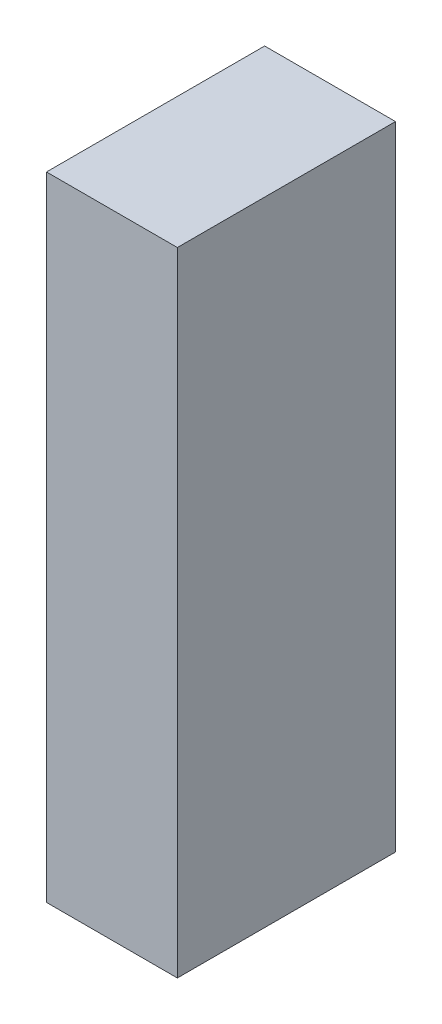
ISO-10303-21;
HEADER;
FILE_DESCRIPTION(('STEP AP214'),'2;1');
FILE_NAME('part.step','',(''),(''),'','','');
FILE_SCHEMA(('AUTOMOTIVE_DESIGN { 1 0 10303 214 1 1 1 1 }'));
ENDSEC;
DATA;
#1=APPLICATION_CONTEXT('core data for automotive mechanical design processes');
#2=APPLICATION_PROTOCOL_DEFINITION('international standard','automotive_design',2000,#1);
#3=PRODUCT_CONTEXT('',#1,'mechanical');
#4=PRODUCT('Part','Part','',(#3));
#5=PRODUCT_RELATED_PRODUCT_CATEGORY('part','',(#4));
#6=PRODUCT_DEFINITION_FORMATION('','',#4);
#7=PRODUCT_DEFINITION_CONTEXT('part definition',#1,'design');
#8=PRODUCT_DEFINITION('design','',#6,#7);
#9=PRODUCT_DEFINITION_SHAPE('','',#8);
#10=(LENGTH_UNIT() NAMED_UNIT(*) SI_UNIT(.MILLI.,.METRE.));
#11=(NAMED_UNIT(*) PLANE_ANGLE_UNIT() SI_UNIT($,.RADIAN.));
#12=(NAMED_UNIT(*) SI_UNIT($,.STERADIAN.) SOLID_ANGLE_UNIT());
#13=UNCERTAINTY_MEASURE_WITH_UNIT(LENGTH_MEASURE(1.E-05),#10,'distance_accuracy_value','');
#14=(GEOMETRIC_REPRESENTATION_CONTEXT(3) GLOBAL_UNCERTAINTY_ASSIGNED_CONTEXT((#13)) GLOBAL_UNIT_ASSIGNED_CONTEXT((#10,
#11,#12)) REPRESENTATION_CONTEXT('',''));
#15=CARTESIAN_POINT('',(0.,0.,0.));
#16=DIRECTION('',(0.,0.,1.));
#17=DIRECTION('',(1.,0.,0.));
#18=AXIS2_PLACEMENT_3D('',#15,#16,#17);
#19=CARTESIAN_POINT('',(-1.0999755859375,-0.724998474121094,-2.64111989736557));
#20=DIRECTION('',(0.,-1.,0.));
#21=DIRECTION('',(1.,0.,0.));
#22=AXIS2_PLACEMENT_3D('',#19,#20,#21);
#23=PLANE('',#22);
#24=DIRECTION('',(1.,0.,0.));
#25=VECTOR('',#24,1.);
#26=CARTESIAN_POINT('',(-1.0999755859375,-0.724998474121094,-2.64111989736557));
#27=LINE('',#26,#25);
#28=CARTESIAN_POINT('',(-1.0999755859375,-0.724998474121094,-2.64111989736557));
#29=VERTEX_POINT('',#28);
#30=CARTESIAN_POINT('',(-0.800018310546875,-0.724998474121094,-2.64111989736557));
#31=VERTEX_POINT('',#30);
#32=EDGE_CURVE('E11',#29,#31,#27,.T.);
#33=ORIENTED_EDGE('',*,*,#32,.T.);
#34=DIRECTION('',(0.,0.,1.));
#35=VECTOR('',#34,1.);
#36=CARTESIAN_POINT('',(-0.800018310546875,-0.724998474121094,-2.64111989736557));
#37=LINE('',#36,#35);
#38=CARTESIAN_POINT('',(-0.800018310546875,-0.724998474121094,-2.14112091064453));
#39=VERTEX_POINT('',#38);
#40=EDGE_CURVE('E88',#31,#39,#37,.T.);
#41=ORIENTED_EDGE('',*,*,#40,.T.);
#42=DIRECTION('',(1.,0.,0.));
#43=VECTOR('',#42,1.);
#44=CARTESIAN_POINT('',(-1.0999755859375,-0.724998474121094,-2.14112091064453));
#45=LINE('',#44,#43);
#46=CARTESIAN_POINT('',(-1.0999755859375,-0.724998474121094,-2.14112091064453));
#47=VERTEX_POINT('',#46);
#48=EDGE_CURVE('E83',#47,#39,#45,.T.);
#49=ORIENTED_EDGE('',*,*,#48,.F.);
#50=DIRECTION('',(0.,0.,1.));
#51=VECTOR('',#50,1.);
#52=CARTESIAN_POINT('',(-1.0999755859375,-0.724998474121094,-2.64111989736557));
#53=LINE('',#52,#51);
#54=EDGE_CURVE('E72',#29,#47,#53,.T.);
#55=ORIENTED_EDGE('',*,*,#54,.F.);
#56=EDGE_LOOP('',(#33,#41,#49,#55));
#57=FACE_BOUND('',#56,.T.);
#58=ADVANCED_FACE('F17',(#57),#23,.T.);
#59=CARTESIAN_POINT('',(-0.800018310546875,-0.724998474121094,-2.64111989736557));
#60=DIRECTION('',(1.,0.,0.));
#61=DIRECTION('',(0.,1.,0.));
#62=AXIS2_PLACEMENT_3D('',#59,#60,#61);
#63=PLANE('',#62);
#64=DIRECTION('',(0.,1.,0.));
#65=VECTOR('',#64,1.);
#66=CARTESIAN_POINT('',(-0.800018310546875,-0.724998474121094,-2.64111989736557));
#67=LINE('',#66,#65);
#68=CARTESIAN_POINT('',(-0.800018310546875,0.724998474121094,-2.64111989736557));
#69=VERTEX_POINT('',#68);
#70=EDGE_CURVE('E24',#31,#69,#67,.T.);
#71=ORIENTED_EDGE('',*,*,#70,.T.);
#72=DIRECTION('',(0.,0.,1.));
#73=VECTOR('',#72,1.);
#74=CARTESIAN_POINT('',(-0.800018310546875,0.724998474121094,-2.64111989736557));
#75=LINE('',#74,#73);
#76=CARTESIAN_POINT('',(-0.800018310546875,0.724998474121094,-2.14112091064453));
#77=VERTEX_POINT('',#76);
#78=EDGE_CURVE('E85',#69,#77,#75,.T.);
#79=ORIENTED_EDGE('',*,*,#78,.T.);
#80=DIRECTION('',(0.,1.,0.));
#81=VECTOR('',#80,1.);
#82=CARTESIAN_POINT('',(-0.800018310546875,-0.724998474121094,-2.14112091064453));
#83=LINE('',#82,#81);
#84=EDGE_CURVE('E66',#39,#77,#83,.T.);
#85=ORIENTED_EDGE('',*,*,#84,.F.);
#86=ORIENTED_EDGE('',*,*,#40,.F.);
#87=EDGE_LOOP('',(#71,#79,#85,#86));
#88=FACE_BOUND('',#87,.T.);
#89=ADVANCED_FACE('F89',(#88),#63,.T.);
#90=CARTESIAN_POINT('',(-0.800018310546875,0.724998474121094,-2.64111989736557));
#91=DIRECTION('',(0.,1.,0.));
#92=DIRECTION('',(-1.,0.,0.));
#93=AXIS2_PLACEMENT_3D('',#90,#91,#92);
#94=PLANE('',#93);
#95=DIRECTION('',(-1.,0.,0.));
#96=VECTOR('',#95,1.);
#97=CARTESIAN_POINT('',(-0.800018310546875,0.724998474121094,-2.64111989736557));
#98=LINE('',#97,#96);
#99=CARTESIAN_POINT('',(-1.0999755859375,0.724998474121094,-2.64111989736557));
#100=VERTEX_POINT('',#99);
#101=EDGE_CURVE('E62',#69,#100,#98,.T.);
#102=ORIENTED_EDGE('',*,*,#101,.T.);
#103=DIRECTION('',(0.,0.,1.));
#104=VECTOR('',#103,1.);
#105=CARTESIAN_POINT('',(-1.0999755859375,0.724998474121094,-2.64111989736557));
#106=LINE('',#105,#104);
#107=CARTESIAN_POINT('',(-1.0999755859375,0.724998474121094,-2.14112091064453));
#108=VERTEX_POINT('',#107);
#109=EDGE_CURVE('E55',#100,#108,#106,.T.);
#110=ORIENTED_EDGE('',*,*,#109,.T.);
#111=DIRECTION('',(-1.,0.,0.));
#112=VECTOR('',#111,1.);
#113=CARTESIAN_POINT('',(-0.800018310546875,0.724998474121094,-2.14112091064453));
#114=LINE('',#113,#112);
#115=EDGE_CURVE('E59',#77,#108,#114,.T.);
#116=ORIENTED_EDGE('',*,*,#115,.F.);
#117=ORIENTED_EDGE('',*,*,#78,.F.);
#118=EDGE_LOOP('',(#102,#110,#116,#117));
#119=FACE_BOUND('',#118,.T.);
#120=ADVANCED_FACE('F57',(#119),#94,.T.);
#121=CARTESIAN_POINT('',(-1.0999755859375,0.724998474121094,-2.64111989736557));
#122=DIRECTION('',(-1.,0.,0.));
#123=DIRECTION('',(0.,-1.,0.));
#124=AXIS2_PLACEMENT_3D('',#121,#122,#123);
#125=PLANE('',#124);
#126=DIRECTION('',(0.,-1.,0.));
#127=VECTOR('',#126,1.);
#128=CARTESIAN_POINT('',(-1.0999755859375,0.724998474121094,-2.64111989736557));
#129=LINE('',#128,#127);
#130=EDGE_CURVE('E65',#100,#29,#129,.T.);
#131=ORIENTED_EDGE('',*,*,#130,.T.);
#132=ORIENTED_EDGE('',*,*,#54,.T.);
#133=DIRECTION('',(0.,-1.,0.));
#134=VECTOR('',#133,1.);
#135=CARTESIAN_POINT('',(-1.0999755859375,0.724998474121094,-2.14112091064453));
#136=LINE('',#135,#134);
#137=EDGE_CURVE('E70',#108,#47,#136,.T.);
#138=ORIENTED_EDGE('',*,*,#137,.F.);
#139=ORIENTED_EDGE('',*,*,#109,.F.);
#140=EDGE_LOOP('',(#131,#132,#138,#139));
#141=FACE_BOUND('',#140,.T.);
#142=ADVANCED_FACE('F71',(#141),#125,.T.);
#143=CARTESIAN_POINT('',(-376.649993896484,-95.8000030517578,-2.14112091064453));
#144=DIRECTION('',(0.,0.,1.));
#145=DIRECTION('',(1.,0.,0.));
#146=AXIS2_PLACEMENT_3D('',#143,#144,#145);
#147=PLANE('',#146);
#148=ORIENTED_EDGE('',*,*,#48,.T.);
#149=ORIENTED_EDGE('',*,*,#84,.T.);
#150=ORIENTED_EDGE('',*,*,#115,.T.);
#151=ORIENTED_EDGE('',*,*,#137,.T.);
#152=EDGE_LOOP('',(#148,#149,#150,#151));
#153=FACE_BOUND('',#152,.T.);
#154=ADVANCED_FACE('F76',(#153),#147,.T.);
#155=CARTESIAN_POINT('',(-376.649993896484,-95.8000030517578,-2.64111989736557));
#156=DIRECTION('',(0.,0.,1.));
#157=DIRECTION('',(1.,0.,0.));
#158=AXIS2_PLACEMENT_3D('',#155,#156,#157);
#159=PLANE('',#158);
#160=ORIENTED_EDGE('',*,*,#130,.F.);
#161=ORIENTED_EDGE('',*,*,#101,.F.);
#162=ORIENTED_EDGE('',*,*,#70,.F.);
#163=ORIENTED_EDGE('',*,*,#32,.F.);
#164=EDGE_LOOP('',(#160,#161,#162,#163));
#165=FACE_BOUND('',#164,.T.);
#166=ADVANCED_FACE('F91',(#165),#159,.F.);
#167=CLOSED_SHELL('',(#58,#89,#120,#142,#154,#166));
#168=MANIFOLD_SOLID_BREP('B1',#167);
#169=ADVANCED_BREP_SHAPE_REPRESENTATION('',(#18,#168),#14);
#170=SHAPE_DEFINITION_REPRESENTATION(#9,#169);
ENDSEC;
END-ISO-10303-21;
